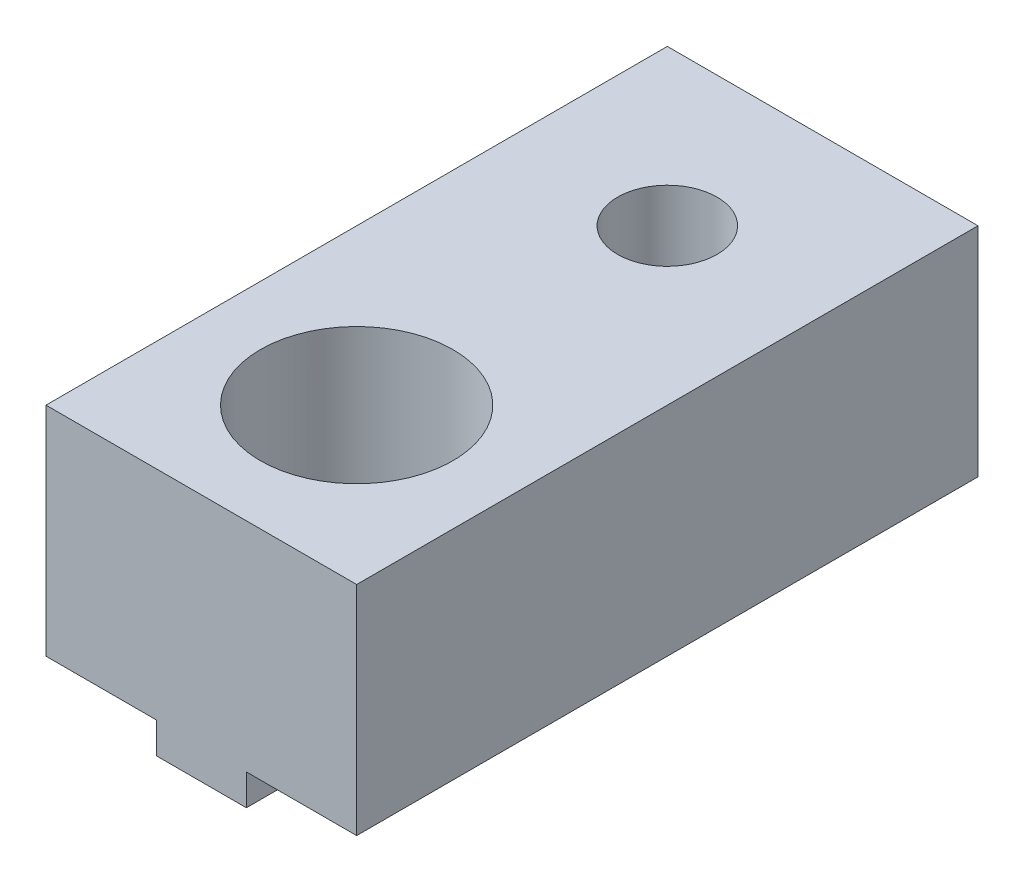
ISO-10303-21;
HEADER;
FILE_DESCRIPTION(('STEP AP214'),'2;1');
FILE_NAME('part.step','',(''),(''),'','','');
FILE_SCHEMA(('AUTOMOTIVE_DESIGN { 1 0 10303 214 1 1 1 1 }'));
ENDSEC;
DATA;
#1=APPLICATION_CONTEXT('core data for automotive mechanical design processes');
#2=APPLICATION_PROTOCOL_DEFINITION('international standard','automotive_design',2000,#1);
#3=PRODUCT_CONTEXT('',#1,'mechanical');
#4=PRODUCT('Part','Part','',(#3));
#5=PRODUCT_RELATED_PRODUCT_CATEGORY('part','',(#4));
#6=PRODUCT_DEFINITION_FORMATION('','',#4);
#7=PRODUCT_DEFINITION_CONTEXT('part definition',#1,'design');
#8=PRODUCT_DEFINITION('design','',#6,#7);
#9=PRODUCT_DEFINITION_SHAPE('','',#8);
#10=(LENGTH_UNIT() NAMED_UNIT(*) SI_UNIT(.MILLI.,.METRE.));
#11=(NAMED_UNIT(*) PLANE_ANGLE_UNIT() SI_UNIT($,.RADIAN.));
#12=(NAMED_UNIT(*) SI_UNIT($,.STERADIAN.) SOLID_ANGLE_UNIT());
#13=UNCERTAINTY_MEASURE_WITH_UNIT(LENGTH_MEASURE(1.E-05),#10,'distance_accuracy_value','');
#14=(GEOMETRIC_REPRESENTATION_CONTEXT(3) GLOBAL_UNCERTAINTY_ASSIGNED_CONTEXT((#13)) GLOBAL_UNIT_ASSIGNED_CONTEXT((#10,
#11,#12)) REPRESENTATION_CONTEXT('',''));
#15=CARTESIAN_POINT('',(0.,0.,0.));
#16=DIRECTION('',(0.,0.,1.));
#17=DIRECTION('',(1.,0.,0.));
#18=AXIS2_PLACEMENT_3D('',#15,#16,#17);
#19=CARTESIAN_POINT('',(-1.45,0.,20.));
#20=DIRECTION('',(1.,0.,0.));
#21=DIRECTION('',(0.,0.,-1.));
#22=AXIS2_PLACEMENT_3D('',#19,#20,#21);
#23=PLANE('',#22);
#24=DIRECTION('',(0.,0.,-1.));
#25=VECTOR('',#24,1.);
#26=CARTESIAN_POINT('',(-1.45,-1.,20.));
#27=LINE('',#26,#25);
#28=CARTESIAN_POINT('',(-1.45,-1.,4.32361253707656));
#29=VERTEX_POINT('',#28);
#30=CARTESIAN_POINT('',(-1.45,-1.,0.));
#31=VERTEX_POINT('',#30);
#32=EDGE_CURVE('E172',#29,#31,#27,.T.);
#33=ORIENTED_EDGE('',*,*,#32,.F.);
#34=DIRECTION('',(0.,1.,0.));
#35=VECTOR('',#34,1.);
#36=CARTESIAN_POINT('',(-1.45,-1.,4.32361253707656));
#37=LINE('',#36,#35);
#38=CARTESIAN_POINT('',(-1.45,0.,4.32361253707656));
#39=VERTEX_POINT('',#38);
#40=EDGE_CURVE('E196',#29,#39,#37,.T.);
#41=ORIENTED_EDGE('',*,*,#40,.T.);
#42=DIRECTION('',(0.,0.,-1.));
#43=VECTOR('',#42,1.);
#44=CARTESIAN_POINT('',(-1.45,0.,20.));
#45=LINE('',#44,#43);
#46=CARTESIAN_POINT('',(-1.45,0.,0.));
#47=VERTEX_POINT('',#46);
#48=EDGE_CURVE('E179',#39,#47,#45,.T.);
#49=ORIENTED_EDGE('',*,*,#48,.T.);
#50=DIRECTION('',(0.,-1.,0.));
#51=VECTOR('',#50,1.);
#52=CARTESIAN_POINT('',(-1.45,0.,0.));
#53=LINE('',#52,#51);
#54=EDGE_CURVE('E194',#47,#31,#53,.T.);
#55=ORIENTED_EDGE('',*,*,#54,.T.);
#56=EDGE_LOOP('',(#33,#41,#49,#55));
#57=FACE_BOUND('',#56,.T.);
#58=ADVANCED_FACE('F33',(#57),#23,.F.);
#59=CARTESIAN_POINT('',(-1.45,-1.,20.));
#60=DIRECTION('',(0.,1.,0.));
#61=DIRECTION('',(-1.,0.,0.));
#62=AXIS2_PLACEMENT_3D('',#59,#60,#61);
#63=PLANE('',#62);
#64=CARTESIAN_POINT('',(-1.45,-1.,12.2600182482359));
#65=VERTEX_POINT('',#64);
#66=CARTESIAN_POINT('',(-1.45,-1.,5.67638746292344));
#67=VERTEX_POINT('',#66);
#68=EDGE_CURVE('E163',#65,#67,#27,.T.);
#69=ORIENTED_EDGE('',*,*,#68,.T.);
#70=CARTESIAN_POINT('',(0.,-1.,5.));
#71=DIRECTION('',(0.,1.,0.));
#72=DIRECTION('',(0.,0.,1.));
#73=AXIS2_PLACEMENT_3D('',#70,#71,#72);
#74=CIRCLE('',#73,1.6);
#75=CARTESIAN_POINT('',(1.45,-1.,5.67638746292343));
#76=VERTEX_POINT('',#75);
#77=EDGE_CURVE('E147',#67,#76,#74,.T.);
#78=ORIENTED_EDGE('',*,*,#77,.T.);
#79=DIRECTION('',(0.,0.,-1.));
#80=VECTOR('',#79,1.);
#81=CARTESIAN_POINT('',(1.45,-1.,20.));
#82=LINE('',#81,#80);
#83=CARTESIAN_POINT('',(1.45,-1.,12.2600182482359));
#84=VERTEX_POINT('',#83);
#85=EDGE_CURVE('E161',#84,#76,#82,.T.);
#86=ORIENTED_EDGE('',*,*,#85,.F.);
#87=CARTESIAN_POINT('',(0.,-1.,15.));
#88=DIRECTION('',(0.,1.,0.));
#89=DIRECTION('',(-1.,0.,0.));
#90=AXIS2_PLACEMENT_3D('',#87,#88,#89);
#91=CIRCLE('',#90,3.1);
#92=EDGE_CURVE('E309',#84,#65,#91,.T.);
#93=ORIENTED_EDGE('',*,*,#92,.T.);
#94=EDGE_LOOP('',(#69,#78,#86,#93));
#95=FACE_BOUND('',#94,.T.);
#96=ADVANCED_FACE('F159',(#95),#63,.F.);
#97=CARTESIAN_POINT('',(1.45,-1.,20.));
#98=DIRECTION('',(-1.,0.,0.));
#99=DIRECTION('',(0.,0.,1.));
#100=AXIS2_PLACEMENT_3D('',#97,#98,#99);
#101=PLANE('',#100);
#102=ORIENTED_EDGE('',*,*,#85,.T.);
#103=DIRECTION('',(0.,1.,0.));
#104=VECTOR('',#103,1.);
#105=CARTESIAN_POINT('',(1.45,-1.,5.67638746292343));
#106=LINE('',#105,#104);
#107=CARTESIAN_POINT('',(1.45,0.,5.67638746292343));
#108=VERTEX_POINT('',#107);
#109=EDGE_CURVE('E144',#76,#108,#106,.T.);
#110=ORIENTED_EDGE('',*,*,#109,.T.);
#111=DIRECTION('',(0.,0.,-1.));
#112=VECTOR('',#111,1.);
#113=CARTESIAN_POINT('',(1.45,0.,20.));
#114=LINE('',#113,#112);
#115=CARTESIAN_POINT('',(1.45,0.,12.2600182482359));
#116=VERTEX_POINT('',#115);
#117=EDGE_CURVE('E238',#116,#108,#114,.T.);
#118=ORIENTED_EDGE('',*,*,#117,.F.);
#119=DIRECTION('',(0.,1.,0.));
#120=VECTOR('',#119,1.);
#121=CARTESIAN_POINT('',(1.45,-1.,12.2600182482359));
#122=LINE('',#121,#120);
#123=EDGE_CURVE('E56',#116,#84,#122,.F.);
#124=ORIENTED_EDGE('',*,*,#123,.T.);
#125=EDGE_LOOP('',(#102,#110,#118,#124));
#126=FACE_BOUND('',#125,.T.);
#127=ADVANCED_FACE('F167',(#126),#101,.F.);
#128=CARTESIAN_POINT('',(-1.45,0.,12.2600182482359));
#129=VERTEX_POINT('',#128);
#130=CARTESIAN_POINT('',(-1.45,0.,5.67638746292344));
#131=VERTEX_POINT('',#130);
#132=EDGE_CURVE('E181',#129,#131,#45,.T.);
#133=ORIENTED_EDGE('',*,*,#132,.T.);
#134=DIRECTION('',(0.,1.,0.));
#135=VECTOR('',#134,1.);
#136=CARTESIAN_POINT('',(-1.45,-1.,5.67638746292344));
#137=LINE('',#136,#135);
#138=EDGE_CURVE('E303',#131,#67,#137,.F.);
#139=ORIENTED_EDGE('',*,*,#138,.T.);
#140=ORIENTED_EDGE('',*,*,#68,.F.);
#141=DIRECTION('',(0.,1.,0.));
#142=VECTOR('',#141,1.);
#143=CARTESIAN_POINT('',(-1.45,-1.,12.2600182482359));
#144=LINE('',#143,#142);
#145=EDGE_CURVE('E264',#65,#129,#144,.T.);
#146=ORIENTED_EDGE('',*,*,#145,.T.);
#147=EDGE_LOOP('',(#133,#139,#140,#146));
#148=FACE_BOUND('',#147,.T.);
#149=ADVANCED_FACE('F314',(#148),#23,.F.);
#150=CARTESIAN_POINT('',(-1.45,-1.,20.));
#151=VERTEX_POINT('',#150);
#152=CARTESIAN_POINT('',(-1.45,-1.,17.7399817517641));
#153=VERTEX_POINT('',#152);
#154=EDGE_CURVE('E177',#151,#153,#27,.T.);
#155=ORIENTED_EDGE('',*,*,#154,.T.);
#156=CARTESIAN_POINT('',(1.45,-1.,17.739981751764));
#157=VERTEX_POINT('',#156);
#158=EDGE_CURVE('E307',#153,#157,#91,.T.);
#159=ORIENTED_EDGE('',*,*,#158,.T.);
#160=CARTESIAN_POINT('',(1.45,-1.,20.));
#161=VERTEX_POINT('',#160);
#162=EDGE_CURVE('E168',#161,#157,#82,.T.);
#163=ORIENTED_EDGE('',*,*,#162,.F.);
#164=DIRECTION('',(1.,0.,0.));
#165=VECTOR('',#164,1.);
#166=CARTESIAN_POINT('',(-1.45,-1.,20.));
#167=LINE('',#166,#165);
#168=EDGE_CURVE('E273',#151,#161,#167,.T.);
#169=ORIENTED_EDGE('',*,*,#168,.F.);
#170=EDGE_LOOP('',(#155,#159,#163,#169));
#171=FACE_BOUND('',#170,.T.);
#172=ADVANCED_FACE('F321',(#171),#63,.F.);
#173=ORIENTED_EDGE('',*,*,#162,.T.);
#174=DIRECTION('',(0.,1.,0.));
#175=VECTOR('',#174,1.);
#176=CARTESIAN_POINT('',(1.45,-1.,17.739981751764));
#177=LINE('',#176,#175);
#178=CARTESIAN_POINT('',(1.45,0.,17.739981751764));
#179=VERTEX_POINT('',#178);
#180=EDGE_CURVE('E252',#157,#179,#177,.T.);
#181=ORIENTED_EDGE('',*,*,#180,.T.);
#182=CARTESIAN_POINT('',(1.45,0.,20.));
#183=VERTEX_POINT('',#182);
#184=EDGE_CURVE('E173',#183,#179,#114,.T.);
#185=ORIENTED_EDGE('',*,*,#184,.F.);
#186=DIRECTION('',(0.,1.,0.));
#187=VECTOR('',#186,1.);
#188=CARTESIAN_POINT('',(1.45,-1.,20.));
#189=LINE('',#188,#187);
#190=EDGE_CURVE('E251',#161,#183,#189,.T.);
#191=ORIENTED_EDGE('',*,*,#190,.F.);
#192=EDGE_LOOP('',(#173,#181,#185,#191));
#193=FACE_BOUND('',#192,.T.);
#194=ADVANCED_FACE('F250',(#193),#101,.F.);
#195=CARTESIAN_POINT('',(-5.,0.,20.));
#196=DIRECTION('',(1.,0.,0.));
#197=DIRECTION('',(0.,1.,0.));
#198=AXIS2_PLACEMENT_3D('',#195,#196,#197);
#199=PLANE('',#198);
#200=DIRECTION('',(0.,-1.,0.));
#201=VECTOR('',#200,1.);
#202=CARTESIAN_POINT('',(-5.,0.,0.));
#203=LINE('',#202,#201);
#204=CARTESIAN_POINT('',(-5.,6.99999999999999,0.));
#205=VERTEX_POINT('',#204);
#206=CARTESIAN_POINT('',(-5.,0.,0.));
#207=VERTEX_POINT('',#206);
#208=EDGE_CURVE('E205',#205,#207,#203,.T.);
#209=ORIENTED_EDGE('',*,*,#208,.T.);
#210=DIRECTION('',(0.,0.,-1.));
#211=VECTOR('',#210,1.);
#212=CARTESIAN_POINT('',(-5.,0.,20.));
#213=LINE('',#212,#211);
#214=CARTESIAN_POINT('',(-5.,0.,20.));
#215=VERTEX_POINT('',#214);
#216=EDGE_CURVE('E11',#215,#207,#213,.T.);
#217=ORIENTED_EDGE('',*,*,#216,.F.);
#218=DIRECTION('',(0.,-1.,0.));
#219=VECTOR('',#218,1.);
#220=CARTESIAN_POINT('',(-5.,0.,20.));
#221=LINE('',#220,#219);
#222=CARTESIAN_POINT('',(-5.,6.99999999999999,20.));
#223=VERTEX_POINT('',#222);
#224=EDGE_CURVE('E224',#223,#215,#221,.T.);
#225=ORIENTED_EDGE('',*,*,#224,.F.);
#226=DIRECTION('',(0.,0.,-1.));
#227=VECTOR('',#226,1.);
#228=CARTESIAN_POINT('',(-5.,6.99999999999999,20.));
#229=LINE('',#228,#227);
#230=EDGE_CURVE('E225',#223,#205,#229,.T.);
#231=ORIENTED_EDGE('',*,*,#230,.T.);
#232=EDGE_LOOP('',(#209,#217,#225,#231));
#233=FACE_BOUND('',#232,.T.);
#234=ADVANCED_FACE('F35',(#233),#199,.F.);
#235=CARTESIAN_POINT('',(-5.,0.,20.));
#236=DIRECTION('',(0.,1.,0.));
#237=DIRECTION('',(-1.,0.,0.));
#238=AXIS2_PLACEMENT_3D('',#235,#236,#237);
#239=PLANE('',#238);
#240=ORIENTED_EDGE('',*,*,#48,.F.);
#241=CARTESIAN_POINT('',(0.,0.,5.));
#242=DIRECTION('',(0.,1.,0.));
#243=DIRECTION('',(-1.,0.,0.));
#244=AXIS2_PLACEMENT_3D('',#241,#242,#243);
#245=CIRCLE('',#244,1.6);
#246=EDGE_CURVE('E154',#39,#131,#245,.T.);
#247=ORIENTED_EDGE('',*,*,#246,.T.);
#248=ORIENTED_EDGE('',*,*,#132,.F.);
#249=CARTESIAN_POINT('',(0.,0.,15.));
#250=DIRECTION('',(0.,1.,0.));
#251=DIRECTION('',(-1.,0.,0.));
#252=AXIS2_PLACEMENT_3D('',#249,#250,#251);
#253=CIRCLE('',#252,3.1);
#254=CARTESIAN_POINT('',(-1.45,0.,17.7399817517641));
#255=VERTEX_POINT('',#254);
#256=EDGE_CURVE('E257',#129,#255,#253,.T.);
#257=ORIENTED_EDGE('',*,*,#256,.T.);
#258=CARTESIAN_POINT('',(-1.45,0.,20.));
#259=VERTEX_POINT('',#258);
#260=EDGE_CURVE('E41',#259,#255,#45,.T.);
#261=ORIENTED_EDGE('',*,*,#260,.F.);
#262=DIRECTION('',(1.,0.,0.));
#263=VECTOR('',#262,1.);
#264=CARTESIAN_POINT('',(-5.,0.,20.));
#265=LINE('',#264,#263);
#266=EDGE_CURVE('E269',#215,#259,#265,.T.);
#267=ORIENTED_EDGE('',*,*,#266,.F.);
#268=ORIENTED_EDGE('',*,*,#216,.T.);
#269=DIRECTION('',(1.,0.,0.));
#270=VECTOR('',#269,1.);
#271=CARTESIAN_POINT('',(-5.,0.,0.));
#272=LINE('',#271,#270);
#273=EDGE_CURVE('E199',#207,#47,#272,.T.);
#274=ORIENTED_EDGE('',*,*,#273,.T.);
#275=EDGE_LOOP('',(#240,#247,#248,#257,#261,#267,#268,#274));
#276=FACE_BOUND('',#275,.T.);
#277=ADVANCED_FACE('F200',(#276),#239,.F.);
#278=ORIENTED_EDGE('',*,*,#260,.T.);
#279=DIRECTION('',(0.,1.,0.));
#280=VECTOR('',#279,1.);
#281=CARTESIAN_POINT('',(-1.45,-1.,17.7399817517641));
#282=LINE('',#281,#280);
#283=EDGE_CURVE('E255',#255,#153,#282,.F.);
#284=ORIENTED_EDGE('',*,*,#283,.T.);
#285=ORIENTED_EDGE('',*,*,#154,.F.);
#286=DIRECTION('',(0.,-1.,0.));
#287=VECTOR('',#286,1.);
#288=CARTESIAN_POINT('',(-1.45,0.,20.));
#289=LINE('',#288,#287);
#290=EDGE_CURVE('E271',#259,#151,#289,.T.);
#291=ORIENTED_EDGE('',*,*,#290,.F.);
#292=EDGE_LOOP('',(#278,#284,#285,#291));
#293=FACE_BOUND('',#292,.T.);
#294=ADVANCED_FACE('F318',(#293),#23,.F.);
#295=CARTESIAN_POINT('',(1.45,-1.,4.32361253707657));
#296=VERTEX_POINT('',#295);
#297=CARTESIAN_POINT('',(1.45,-1.,0.));
#298=VERTEX_POINT('',#297);
#299=EDGE_CURVE('E169',#296,#298,#82,.T.);
#300=ORIENTED_EDGE('',*,*,#299,.F.);
#301=EDGE_CURVE('E164',#296,#29,#74,.T.);
#302=ORIENTED_EDGE('',*,*,#301,.T.);
#303=ORIENTED_EDGE('',*,*,#32,.T.);
#304=DIRECTION('',(1.,0.,0.));
#305=VECTOR('',#304,1.);
#306=CARTESIAN_POINT('',(-1.45,-1.,0.));
#307=LINE('',#306,#305);
#308=EDGE_CURVE('E210',#31,#298,#307,.T.);
#309=ORIENTED_EDGE('',*,*,#308,.T.);
#310=EDGE_LOOP('',(#300,#302,#303,#309));
#311=FACE_BOUND('',#310,.T.);
#312=ADVANCED_FACE('F296',(#311),#63,.F.);
#313=CARTESIAN_POINT('',(1.45,0.,4.32361253707657));
#314=VERTEX_POINT('',#313);
#315=CARTESIAN_POINT('',(1.45,0.,0.));
#316=VERTEX_POINT('',#315);
#317=EDGE_CURVE('E233',#314,#316,#114,.T.);
#318=ORIENTED_EDGE('',*,*,#317,.F.);
#319=DIRECTION('',(0.,1.,0.));
#320=VECTOR('',#319,1.);
#321=CARTESIAN_POINT('',(1.45,-1.,4.32361253707657));
#322=LINE('',#321,#320);
#323=EDGE_CURVE('E48',#314,#296,#322,.F.);
#324=ORIENTED_EDGE('',*,*,#323,.T.);
#325=ORIENTED_EDGE('',*,*,#299,.T.);
#326=DIRECTION('',(0.,1.,0.));
#327=VECTOR('',#326,1.);
#328=CARTESIAN_POINT('',(1.45,-1.,0.));
#329=LINE('',#328,#327);
#330=EDGE_CURVE('E212',#298,#316,#329,.T.);
#331=ORIENTED_EDGE('',*,*,#330,.T.);
#332=EDGE_LOOP('',(#318,#324,#325,#331));
#333=FACE_BOUND('',#332,.T.);
#334=ADVANCED_FACE('F292',(#333),#101,.F.);
#335=CARTESIAN_POINT('',(1.45,0.,20.));
#336=DIRECTION('',(0.,1.,0.));
#337=DIRECTION('',(0.,0.,1.));
#338=AXIS2_PLACEMENT_3D('',#335,#336,#337);
#339=PLANE('',#338);
#340=ORIENTED_EDGE('',*,*,#117,.T.);
#341=CARTESIAN_POINT('',(0.,0.,5.));
#342=DIRECTION('',(0.,1.,0.));
#343=DIRECTION('',(0.,0.,1.));
#344=AXIS2_PLACEMENT_3D('',#341,#342,#343);
#345=CIRCLE('',#344,1.6);
#346=EDGE_CURVE('E149',#108,#314,#345,.T.);
#347=ORIENTED_EDGE('',*,*,#346,.T.);
#348=ORIENTED_EDGE('',*,*,#317,.T.);
#349=DIRECTION('',(1.,0.,0.));
#350=VECTOR('',#349,1.);
#351=CARTESIAN_POINT('',(1.45,0.,0.));
#352=LINE('',#351,#350);
#353=CARTESIAN_POINT('',(5.,0.,0.));
#354=VERTEX_POINT('',#353);
#355=EDGE_CURVE('E218',#316,#354,#352,.T.);
#356=ORIENTED_EDGE('',*,*,#355,.T.);
#357=DIRECTION('',(0.,0.,-1.));
#358=VECTOR('',#357,1.);
#359=CARTESIAN_POINT('',(5.,0.,20.));
#360=LINE('',#359,#358);
#361=CARTESIAN_POINT('',(5.,0.,20.));
#362=VERTEX_POINT('',#361);
#363=EDGE_CURVE('E231',#362,#354,#360,.T.);
#364=ORIENTED_EDGE('',*,*,#363,.F.);
#365=DIRECTION('',(1.,0.,0.));
#366=VECTOR('',#365,1.);
#367=CARTESIAN_POINT('',(1.45,0.,20.));
#368=LINE('',#367,#366);
#369=EDGE_CURVE('E246',#183,#362,#368,.T.);
#370=ORIENTED_EDGE('',*,*,#369,.F.);
#371=ORIENTED_EDGE('',*,*,#184,.T.);
#372=CARTESIAN_POINT('',(0.,0.,15.));
#373=DIRECTION('',(0.,1.,0.));
#374=DIRECTION('',(0.,0.,1.));
#375=AXIS2_PLACEMENT_3D('',#372,#373,#374);
#376=CIRCLE('',#375,3.1);
#377=EDGE_CURVE('E245',#179,#116,#376,.T.);
#378=ORIENTED_EDGE('',*,*,#377,.T.);
#379=EDGE_LOOP('',(#340,#347,#348,#356,#364,#370,#371,#378));
#380=FACE_BOUND('',#379,.T.);
#381=ADVANCED_FACE('F244',(#380),#339,.F.);
#382=CARTESIAN_POINT('',(5.,0.,20.));
#383=DIRECTION('',(-1.,0.,0.));
#384=DIRECTION('',(0.,-1.,0.));
#385=AXIS2_PLACEMENT_3D('',#382,#383,#384);
#386=PLANE('',#385);
#387=DIRECTION('',(0.,1.,0.));
#388=VECTOR('',#387,1.);
#389=CARTESIAN_POINT('',(5.,0.,0.));
#390=LINE('',#389,#388);
#391=CARTESIAN_POINT('',(5.,7.,0.));
#392=VERTEX_POINT('',#391);
#393=EDGE_CURVE('E220',#354,#392,#390,.T.);
#394=ORIENTED_EDGE('',*,*,#393,.T.);
#395=DIRECTION('',(0.,0.,-1.));
#396=VECTOR('',#395,1.);
#397=CARTESIAN_POINT('',(5.,7.,20.));
#398=LINE('',#397,#396);
#399=CARTESIAN_POINT('',(5.,7.,20.));
#400=VERTEX_POINT('',#399);
#401=EDGE_CURVE('E228',#400,#392,#398,.T.);
#402=ORIENTED_EDGE('',*,*,#401,.F.);
#403=DIRECTION('',(0.,1.,0.));
#404=VECTOR('',#403,1.);
#405=CARTESIAN_POINT('',(5.,0.,20.));
#406=LINE('',#405,#404);
#407=EDGE_CURVE('E277',#362,#400,#406,.T.);
#408=ORIENTED_EDGE('',*,*,#407,.F.);
#409=ORIENTED_EDGE('',*,*,#363,.T.);
#410=EDGE_LOOP('',(#394,#402,#408,#409));
#411=FACE_BOUND('',#410,.T.);
#412=ADVANCED_FACE('F288',(#411),#386,.F.);
#413=CARTESIAN_POINT('',(5.,7.,20.));
#414=DIRECTION('',(0.,-1.,0.));
#415=DIRECTION('',(1.,0.,0.));
#416=AXIS2_PLACEMENT_3D('',#413,#414,#415);
#417=PLANE('',#416);
#418=CARTESIAN_POINT('',(0.,7.,5.));
#419=DIRECTION('',(0.,1.,0.));
#420=DIRECTION('',(0.,0.,1.));
#421=AXIS2_PLACEMENT_3D('',#418,#419,#420);
#422=CIRCLE('',#421,1.6);
#423=CARTESIAN_POINT('',(0.,7.,6.6));
#424=VERTEX_POINT('',#423);
#425=EDGE_CURVE('E165',#424,#424,#422,.T.);
#426=ORIENTED_EDGE('',*,*,#425,.F.);
#427=EDGE_LOOP('',(#426));
#428=FACE_BOUND('',#427,.T.);
#429=CARTESIAN_POINT('',(0.,7.,15.));
#430=DIRECTION('',(0.,1.,0.));
#431=DIRECTION('',(-1.,0.,0.));
#432=AXIS2_PLACEMENT_3D('',#429,#430,#431);
#433=CIRCLE('',#432,3.1);
#434=CARTESIAN_POINT('',(-3.1,7.,15.));
#435=VERTEX_POINT('',#434);
#436=EDGE_CURVE('E306',#435,#435,#433,.T.);
#437=ORIENTED_EDGE('',*,*,#436,.F.);
#438=EDGE_LOOP('',(#437));
#439=FACE_BOUND('',#438,.T.);
#440=DIRECTION('',(-1.,0.,0.));
#441=VECTOR('',#440,1.);
#442=CARTESIAN_POINT('',(5.,7.,0.));
#443=LINE('',#442,#441);
#444=EDGE_CURVE('E222',#392,#205,#443,.T.);
#445=ORIENTED_EDGE('',*,*,#444,.T.);
#446=ORIENTED_EDGE('',*,*,#230,.F.);
#447=DIRECTION('',(-1.,0.,0.));
#448=VECTOR('',#447,1.);
#449=CARTESIAN_POINT('',(5.,7.,20.));
#450=LINE('',#449,#448);
#451=EDGE_CURVE('E229',#400,#223,#450,.T.);
#452=ORIENTED_EDGE('',*,*,#451,.F.);
#453=ORIENTED_EDGE('',*,*,#401,.T.);
#454=EDGE_LOOP('',(#445,#446,#452,#453));
#455=FACE_BOUND('',#454,.T.);
#456=ADVANCED_FACE('F285',(#428,#439,#455),#417,.F.);
#457=CARTESIAN_POINT('',(0.,0.,20.));
#458=DIRECTION('',(0.,0.,1.));
#459=DIRECTION('',(1.,0.,0.));
#460=AXIS2_PLACEMENT_3D('',#457,#458,#459);
#461=PLANE('',#460);
#462=ORIENTED_EDGE('',*,*,#224,.T.);
#463=ORIENTED_EDGE('',*,*,#266,.T.);
#464=ORIENTED_EDGE('',*,*,#290,.T.);
#465=ORIENTED_EDGE('',*,*,#168,.T.);
#466=ORIENTED_EDGE('',*,*,#190,.T.);
#467=ORIENTED_EDGE('',*,*,#369,.T.);
#468=ORIENTED_EDGE('',*,*,#407,.T.);
#469=ORIENTED_EDGE('',*,*,#451,.T.);
#470=EDGE_LOOP('',(#462,#463,#464,#465,#466,#467,#468,#469));
#471=FACE_BOUND('',#470,.T.);
#472=ADVANCED_FACE('F290',(#471),#461,.T.);
#473=CARTESIAN_POINT('',(0.,0.,0.));
#474=DIRECTION('',(0.,0.,1.));
#475=DIRECTION('',(1.,0.,0.));
#476=AXIS2_PLACEMENT_3D('',#473,#474,#475);
#477=PLANE('',#476);
#478=ORIENTED_EDGE('',*,*,#208,.F.);
#479=ORIENTED_EDGE('',*,*,#444,.F.);
#480=ORIENTED_EDGE('',*,*,#393,.F.);
#481=ORIENTED_EDGE('',*,*,#355,.F.);
#482=ORIENTED_EDGE('',*,*,#330,.F.);
#483=ORIENTED_EDGE('',*,*,#308,.F.);
#484=ORIENTED_EDGE('',*,*,#54,.F.);
#485=ORIENTED_EDGE('',*,*,#273,.F.);
#486=EDGE_LOOP('',(#478,#479,#480,#481,#482,#483,#484,#485));
#487=FACE_BOUND('',#486,.T.);
#488=ADVANCED_FACE('F207',(#487),#477,.F.);
#489=CARTESIAN_POINT('',(0.,-1.,15.));
#490=DIRECTION('',(0.,1.,0.));
#491=DIRECTION('',(-1.,0.,0.));
#492=AXIS2_PLACEMENT_3D('',#489,#490,#491);
#493=CYLINDRICAL_SURFACE('',#492,3.1);
#494=ORIENTED_EDGE('',*,*,#436,.T.);
#495=EDGE_LOOP('',(#494));
#496=FACE_BOUND('',#495,.T.);
#497=ORIENTED_EDGE('',*,*,#92,.F.);
#498=ORIENTED_EDGE('',*,*,#123,.F.);
#499=ORIENTED_EDGE('',*,*,#377,.F.);
#500=ORIENTED_EDGE('',*,*,#180,.F.);
#501=ORIENTED_EDGE('',*,*,#158,.F.);
#502=ORIENTED_EDGE('',*,*,#283,.F.);
#503=ORIENTED_EDGE('',*,*,#256,.F.);
#504=ORIENTED_EDGE('',*,*,#145,.F.);
#505=EDGE_LOOP('',(#497,#498,#499,#500,#501,#502,#503,#504));
#506=FACE_BOUND('',#505,.T.);
#507=ADVANCED_FACE('F316',(#496,#506),#493,.F.);
#508=CARTESIAN_POINT('',(0.,-1.,5.));
#509=DIRECTION('',(0.,1.,0.));
#510=DIRECTION('',(0.,0.,1.));
#511=AXIS2_PLACEMENT_3D('',#508,#509,#510);
#512=CYLINDRICAL_SURFACE('',#511,1.6);
#513=ORIENTED_EDGE('',*,*,#425,.T.);
#514=EDGE_LOOP('',(#513));
#515=FACE_BOUND('',#514,.T.);
#516=ORIENTED_EDGE('',*,*,#301,.F.);
#517=ORIENTED_EDGE('',*,*,#323,.F.);
#518=ORIENTED_EDGE('',*,*,#346,.F.);
#519=ORIENTED_EDGE('',*,*,#109,.F.);
#520=ORIENTED_EDGE('',*,*,#77,.F.);
#521=ORIENTED_EDGE('',*,*,#138,.F.);
#522=ORIENTED_EDGE('',*,*,#246,.F.);
#523=ORIENTED_EDGE('',*,*,#40,.F.);
#524=EDGE_LOOP('',(#516,#517,#518,#519,#520,#521,#522,#523));
#525=FACE_BOUND('',#524,.T.);
#526=ADVANCED_FACE('F146',(#515,#525),#512,.F.);
#527=CLOSED_SHELL('',(#58,#96,#127,#149,#172,#194,#234,#277,#294,#312,#334,#381,#412,#456,#472,
#488,#507,#526));
#528=MANIFOLD_SOLID_BREP('B2',#527);
#529=ADVANCED_BREP_SHAPE_REPRESENTATION('',(#18,#528),#14);
#530=SHAPE_DEFINITION_REPRESENTATION(#9,#529);
ENDSEC;
END-ISO-10303-21;
